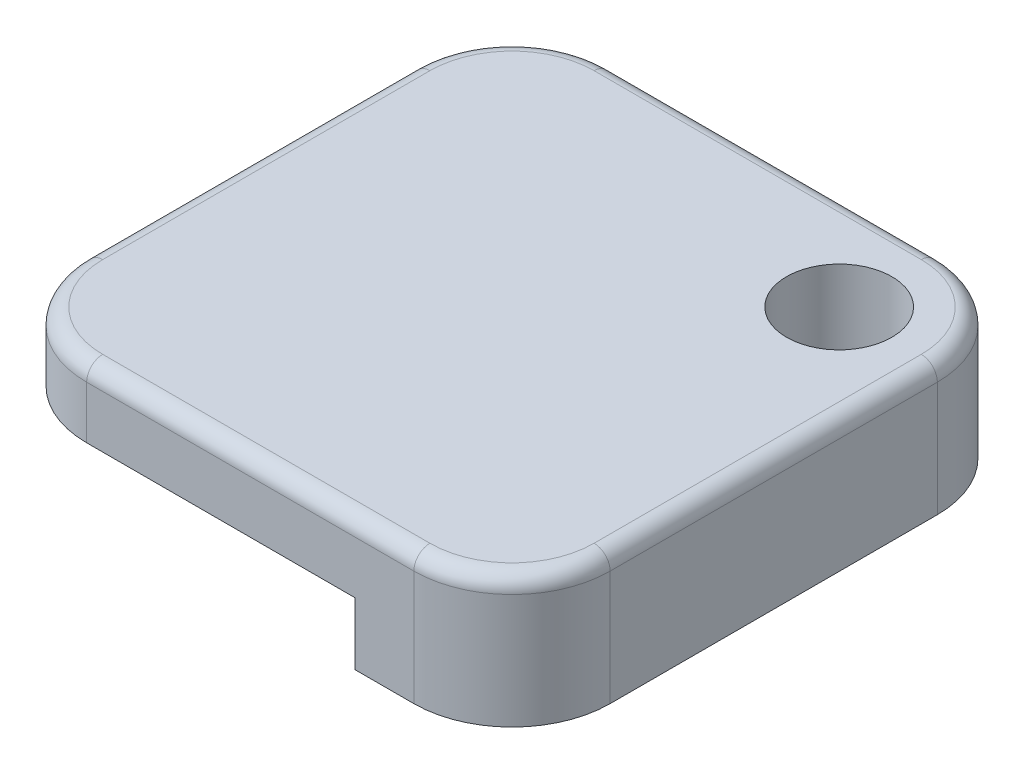
ISO-10303-21;
HEADER;
FILE_DESCRIPTION(('STEP AP214'),'2;1');
FILE_NAME('part.step','',(''),(''),'','','');
FILE_SCHEMA(('AUTOMOTIVE_DESIGN { 1 0 10303 214 1 1 1 1 }'));
ENDSEC;
DATA;
#1=APPLICATION_CONTEXT('core data for automotive mechanical design processes');
#2=APPLICATION_PROTOCOL_DEFINITION('international standard','automotive_design',2000,#1);
#3=PRODUCT_CONTEXT('',#1,'mechanical');
#4=PRODUCT('Part','Part','',(#3));
#5=PRODUCT_RELATED_PRODUCT_CATEGORY('part','',(#4));
#6=PRODUCT_DEFINITION_FORMATION('','',#4);
#7=PRODUCT_DEFINITION_CONTEXT('part definition',#1,'design');
#8=PRODUCT_DEFINITION('design','',#6,#7);
#9=PRODUCT_DEFINITION_SHAPE('','',#8);
#10=(LENGTH_UNIT() NAMED_UNIT(*) SI_UNIT(.MILLI.,.METRE.));
#11=(NAMED_UNIT(*) PLANE_ANGLE_UNIT() SI_UNIT($,.RADIAN.));
#12=(NAMED_UNIT(*) SI_UNIT($,.STERADIAN.) SOLID_ANGLE_UNIT());
#13=UNCERTAINTY_MEASURE_WITH_UNIT(LENGTH_MEASURE(1.E-05),#10,'distance_accuracy_value','');
#14=(GEOMETRIC_REPRESENTATION_CONTEXT(3) GLOBAL_UNCERTAINTY_ASSIGNED_CONTEXT((#13)) GLOBAL_UNIT_ASSIGNED_CONTEXT((#10,
#11,#12)) REPRESENTATION_CONTEXT('',''));
#15=CARTESIAN_POINT('',(0.,0.,0.));
#16=DIRECTION('',(0.,0.,1.));
#17=DIRECTION('',(1.,0.,0.));
#18=AXIS2_PLACEMENT_3D('',#15,#16,#17);
#19=CARTESIAN_POINT('',(12.7,6.35,-12.7));
#20=DIRECTION('',(-1.,0.,0.));
#21=DIRECTION('',(0.,0.,1.));
#22=AXIS2_PLACEMENT_3D('',#19,#20,#21);
#23=PLANE('',#22);
#24=DIRECTION('',(0.,-1.,0.));
#25=VECTOR('',#24,1.);
#26=CARTESIAN_POINT('',(12.7,6.35,-7.9375));
#27=LINE('',#26,#25);
#28=CARTESIAN_POINT('',(12.7,0.,-7.9375));
#29=VERTEX_POINT('',#28);
#30=CARTESIAN_POINT('',(12.7,5.57,-7.9375));
#31=VERTEX_POINT('',#30);
#32=EDGE_CURVE('E206',#29,#31,#27,.F.);
#33=ORIENTED_EDGE('',*,*,#32,.T.);
#34=DIRECTION('',(0.,0.,-1.));
#35=VECTOR('',#34,1.);
#36=CARTESIAN_POINT('',(12.7,5.57,7.93749999999999));
#37=LINE('',#36,#35);
#38=CARTESIAN_POINT('',(12.7,5.57,7.93749999999999));
#39=VERTEX_POINT('',#38);
#40=EDGE_CURVE('E229',#31,#39,#37,.F.);
#41=ORIENTED_EDGE('',*,*,#40,.T.);
#42=DIRECTION('',(0.,-1.,0.));
#43=VECTOR('',#42,1.);
#44=CARTESIAN_POINT('',(12.7,6.35,7.93749999999999));
#45=LINE('',#44,#43);
#46=CARTESIAN_POINT('',(12.7,0.,7.93749999999999));
#47=VERTEX_POINT('',#46);
#48=EDGE_CURVE('E204',#39,#47,#45,.T.);
#49=ORIENTED_EDGE('',*,*,#48,.T.);
#50=DIRECTION('',(0.,0.,-1.));
#51=VECTOR('',#50,1.);
#52=CARTESIAN_POINT('',(12.7,0.,-12.7));
#53=LINE('',#52,#51);
#54=EDGE_CURVE('E174',#47,#29,#53,.T.);
#55=ORIENTED_EDGE('',*,*,#54,.T.);
#56=EDGE_LOOP('',(#33,#41,#49,#55));
#57=FACE_BOUND('',#56,.T.);
#58=ADVANCED_FACE('F33',(#57),#23,.F.);
#59=CARTESIAN_POINT('',(-12.7,6.35,-12.7));
#60=DIRECTION('',(0.,0.,1.));
#61=DIRECTION('',(1.,0.,0.));
#62=AXIS2_PLACEMENT_3D('',#59,#60,#61);
#63=PLANE('',#62);
#64=DIRECTION('',(0.,-1.,0.));
#65=VECTOR('',#64,1.);
#66=CARTESIAN_POINT('',(-7.9375,6.35,-12.7));
#67=LINE('',#66,#65);
#68=CARTESIAN_POINT('',(-7.9375,0.,-12.7));
#69=VERTEX_POINT('',#68);
#70=CARTESIAN_POINT('',(-7.9375,5.57,-12.7));
#71=VERTEX_POINT('',#70);
#72=EDGE_CURVE('E202',#69,#71,#67,.F.);
#73=ORIENTED_EDGE('',*,*,#72,.T.);
#74=DIRECTION('',(-1.,0.,0.));
#75=VECTOR('',#74,1.);
#76=CARTESIAN_POINT('',(7.93749999999999,5.57,-12.7));
#77=LINE('',#76,#75);
#78=CARTESIAN_POINT('',(7.93749999999999,5.57,-12.7));
#79=VERTEX_POINT('',#78);
#80=EDGE_CURVE('E11',#71,#79,#77,.F.);
#81=ORIENTED_EDGE('',*,*,#80,.T.);
#82=DIRECTION('',(0.,-1.,0.));
#83=VECTOR('',#82,1.);
#84=CARTESIAN_POINT('',(7.93749999999999,6.35,-12.7));
#85=LINE('',#84,#83);
#86=CARTESIAN_POINT('',(7.93749999999999,0.,-12.7));
#87=VERTEX_POINT('',#86);
#88=EDGE_CURVE('E200',#79,#87,#85,.T.);
#89=ORIENTED_EDGE('',*,*,#88,.T.);
#90=DIRECTION('',(-1.,0.,0.));
#91=VECTOR('',#90,1.);
#92=CARTESIAN_POINT('',(-12.7,0.,-12.7));
#93=LINE('',#92,#91);
#94=EDGE_CURVE('E177',#87,#69,#93,.T.);
#95=ORIENTED_EDGE('',*,*,#94,.T.);
#96=EDGE_LOOP('',(#73,#81,#89,#95));
#97=FACE_BOUND('',#96,.T.);
#98=ADVANCED_FACE('F313',(#97),#63,.F.);
#99=CARTESIAN_POINT('',(-12.7,6.35,-12.7));
#100=DIRECTION('',(1.,0.,0.));
#101=DIRECTION('',(0.,0.,-1.));
#102=AXIS2_PLACEMENT_3D('',#99,#100,#101);
#103=PLANE('',#102);
#104=DIRECTION('',(0.,-1.,0.));
#105=VECTOR('',#104,1.);
#106=CARTESIAN_POINT('',(-12.7,6.35,7.93749999999999));
#107=LINE('',#106,#105);
#108=CARTESIAN_POINT('',(-12.7,3.0226,7.9375));
#109=VERTEX_POINT('',#108);
#110=CARTESIAN_POINT('',(-12.7,5.57,7.93749999999999));
#111=VERTEX_POINT('',#110);
#112=EDGE_CURVE('E192',#109,#111,#107,.F.);
#113=ORIENTED_EDGE('',*,*,#112,.T.);
#114=DIRECTION('',(0.,0.,1.));
#115=VECTOR('',#114,1.);
#116=CARTESIAN_POINT('',(-12.7,5.57,-7.9375));
#117=LINE('',#116,#115);
#118=CARTESIAN_POINT('',(-12.7,5.57,-7.9375));
#119=VERTEX_POINT('',#118);
#120=EDGE_CURVE('E57',#111,#119,#117,.F.);
#121=ORIENTED_EDGE('',*,*,#120,.T.);
#122=DIRECTION('',(0.,-1.,0.));
#123=VECTOR('',#122,1.);
#124=CARTESIAN_POINT('',(-12.7,6.35,-7.9375));
#125=LINE('',#124,#123);
#126=CARTESIAN_POINT('',(-12.7,0.,-7.9375));
#127=VERTEX_POINT('',#126);
#128=EDGE_CURVE('E190',#119,#127,#125,.T.);
#129=ORIENTED_EDGE('',*,*,#128,.T.);
#130=DIRECTION('',(0.,0.,1.));
#131=VECTOR('',#130,1.);
#132=CARTESIAN_POINT('',(-12.7,0.,-12.7));
#133=LINE('',#132,#131);
#134=CARTESIAN_POINT('',(-12.7,0.,-5.08000000000001));
#135=VERTEX_POINT('',#134);
#136=EDGE_CURVE('E166',#127,#135,#133,.T.);
#137=ORIENTED_EDGE('',*,*,#136,.T.);
#138=DIRECTION('',(0.,-1.,0.));
#139=VECTOR('',#138,1.);
#140=CARTESIAN_POINT('',(-12.7,3.0226,-5.08000000000001));
#141=LINE('',#140,#139);
#142=CARTESIAN_POINT('',(-12.7,3.0226,-5.08000000000001));
#143=VERTEX_POINT('',#142);
#144=EDGE_CURVE('E158',#143,#135,#141,.T.);
#145=ORIENTED_EDGE('',*,*,#144,.F.);
#146=DIRECTION('',(0.,0.,-1.));
#147=VECTOR('',#146,1.);
#148=CARTESIAN_POINT('',(-12.7,3.0226,12.7));
#149=LINE('',#148,#147);
#150=EDGE_CURVE('E142',#109,#143,#149,.T.);
#151=ORIENTED_EDGE('',*,*,#150,.F.);
#152=EDGE_LOOP('',(#113,#121,#129,#137,#145,#151));
#153=FACE_BOUND('',#152,.T.);
#154=ADVANCED_FACE('F164',(#153),#103,.F.);
#155=CARTESIAN_POINT('',(-12.7,6.35,12.7));
#156=DIRECTION('',(0.,0.,-1.));
#157=DIRECTION('',(-1.,0.,0.));
#158=AXIS2_PLACEMENT_3D('',#155,#156,#157);
#159=PLANE('',#158);
#160=DIRECTION('',(0.,-1.,0.));
#161=VECTOR('',#160,1.);
#162=CARTESIAN_POINT('',(7.9375,6.35,12.7));
#163=LINE('',#162,#161);
#164=CARTESIAN_POINT('',(7.9375,0.,12.7));
#165=VERTEX_POINT('',#164);
#166=CARTESIAN_POINT('',(7.9375,5.57,12.7));
#167=VERTEX_POINT('',#166);
#168=EDGE_CURVE('E184',#165,#167,#163,.F.);
#169=ORIENTED_EDGE('',*,*,#168,.T.);
#170=DIRECTION('',(1.,0.,0.));
#171=VECTOR('',#170,1.);
#172=CARTESIAN_POINT('',(-7.9375,5.57,12.7));
#173=LINE('',#172,#171);
#174=CARTESIAN_POINT('',(-7.9375,5.57,12.7));
#175=VERTEX_POINT('',#174);
#176=EDGE_CURVE('E233',#167,#175,#173,.F.);
#177=ORIENTED_EDGE('',*,*,#176,.T.);
#178=DIRECTION('',(0.,-1.,0.));
#179=VECTOR('',#178,1.);
#180=CARTESIAN_POINT('',(-7.9375,6.35,12.7));
#181=LINE('',#180,#179);
#182=CARTESIAN_POINT('',(-7.9375,3.0226,12.7));
#183=VERTEX_POINT('',#182);
#184=EDGE_CURVE('E187',#175,#183,#181,.T.);
#185=ORIENTED_EDGE('',*,*,#184,.T.);
#186=DIRECTION('',(-1.,0.,0.));
#187=VECTOR('',#186,1.);
#188=CARTESIAN_POINT('',(-12.7,3.0226,12.7));
#189=LINE('',#188,#187);
#190=CARTESIAN_POINT('',(5.08,3.0226,12.7));
#191=VERTEX_POINT('',#190);
#192=EDGE_CURVE('E167',#191,#183,#189,.T.);
#193=ORIENTED_EDGE('',*,*,#192,.F.);
#194=DIRECTION('',(0.,-1.,0.));
#195=VECTOR('',#194,1.);
#196=CARTESIAN_POINT('',(5.08,3.0226,12.7));
#197=LINE('',#196,#195);
#198=CARTESIAN_POINT('',(5.08,0.,12.7));
#199=VERTEX_POINT('',#198);
#200=EDGE_CURVE('E169',#191,#199,#197,.T.);
#201=ORIENTED_EDGE('',*,*,#200,.T.);
#202=DIRECTION('',(1.,0.,0.));
#203=VECTOR('',#202,1.);
#204=CARTESIAN_POINT('',(-12.7,0.,12.7));
#205=LINE('',#204,#203);
#206=EDGE_CURVE('E181',#199,#165,#205,.T.);
#207=ORIENTED_EDGE('',*,*,#206,.T.);
#208=EDGE_LOOP('',(#169,#177,#185,#193,#201,#207));
#209=FACE_BOUND('',#208,.T.);
#210=ADVANCED_FACE('F280',(#209),#159,.F.);
#211=CARTESIAN_POINT('',(0.,6.35,0.));
#212=DIRECTION('',(0.,1.,0.));
#213=DIRECTION('',(0.,0.,1.));
#214=AXIS2_PLACEMENT_3D('',#211,#212,#213);
#215=PLANE('',#214);
#216=DIRECTION('',(0.,0.,-1.));
#217=VECTOR('',#216,1.);
#218=CARTESIAN_POINT('',(11.92,6.35,-7.9375));
#219=LINE('',#218,#217);
#220=CARTESIAN_POINT('',(11.92,6.35,7.93749999999999));
#221=VERTEX_POINT('',#220);
#222=CARTESIAN_POINT('',(11.92,6.35,-7.9375));
#223=VERTEX_POINT('',#222);
#224=EDGE_CURVE('E221',#221,#223,#219,.T.);
#225=ORIENTED_EDGE('',*,*,#224,.T.);
#226=CARTESIAN_POINT('',(7.93749999999999,6.35,-7.9375));
#227=DIRECTION('',(0.,1.,0.));
#228=DIRECTION('',(0.,0.,1.));
#229=AXIS2_PLACEMENT_3D('',#226,#227,#228);
#230=CIRCLE('',#229,3.9825);
#231=CARTESIAN_POINT('',(7.93749999999999,6.35,-11.92));
#232=VERTEX_POINT('',#231);
#233=EDGE_CURVE('E223',#223,#232,#230,.T.);
#234=ORIENTED_EDGE('',*,*,#233,.T.);
#235=DIRECTION('',(-1.,0.,0.));
#236=VECTOR('',#235,1.);
#237=CARTESIAN_POINT('',(-7.9375,6.35,-11.92));
#238=LINE('',#237,#236);
#239=CARTESIAN_POINT('',(-7.9375,6.35,-11.92));
#240=VERTEX_POINT('',#239);
#241=EDGE_CURVE('E209',#232,#240,#238,.T.);
#242=ORIENTED_EDGE('',*,*,#241,.T.);
#243=CARTESIAN_POINT('',(-7.9375,6.35,-7.9375));
#244=DIRECTION('',(0.,1.,0.));
#245=DIRECTION('',(0.,0.,1.));
#246=AXIS2_PLACEMENT_3D('',#243,#244,#245);
#247=CIRCLE('',#246,3.9825);
#248=CARTESIAN_POINT('',(-11.92,6.35,-7.9375));
#249=VERTEX_POINT('',#248);
#250=EDGE_CURVE('E211',#240,#249,#247,.T.);
#251=ORIENTED_EDGE('',*,*,#250,.T.);
#252=DIRECTION('',(0.,0.,1.));
#253=VECTOR('',#252,1.);
#254=CARTESIAN_POINT('',(-11.92,6.35,7.93749999999999));
#255=LINE('',#254,#253);
#256=CARTESIAN_POINT('',(-11.92,6.35,7.93749999999999));
#257=VERTEX_POINT('',#256);
#258=EDGE_CURVE('E213',#249,#257,#255,.T.);
#259=ORIENTED_EDGE('',*,*,#258,.T.);
#260=CARTESIAN_POINT('',(-7.9375,6.35,7.9375));
#261=DIRECTION('',(0.,1.,0.));
#262=DIRECTION('',(0.,0.,1.));
#263=AXIS2_PLACEMENT_3D('',#260,#261,#262);
#264=CIRCLE('',#263,3.9825);
#265=CARTESIAN_POINT('',(-7.9375,6.35,11.92));
#266=VERTEX_POINT('',#265);
#267=EDGE_CURVE('E215',#257,#266,#264,.T.);
#268=ORIENTED_EDGE('',*,*,#267,.T.);
#269=DIRECTION('',(1.,0.,0.));
#270=VECTOR('',#269,1.);
#271=CARTESIAN_POINT('',(7.9375,6.35,11.92));
#272=LINE('',#271,#270);
#273=CARTESIAN_POINT('',(7.9375,6.35,11.92));
#274=VERTEX_POINT('',#273);
#275=EDGE_CURVE('E217',#266,#274,#272,.T.);
#276=ORIENTED_EDGE('',*,*,#275,.T.);
#277=CARTESIAN_POINT('',(7.9375,6.35,7.93749999999999));
#278=DIRECTION('',(0.,1.,0.));
#279=DIRECTION('',(0.,0.,1.));
#280=AXIS2_PLACEMENT_3D('',#277,#278,#279);
#281=CIRCLE('',#280,3.9825);
#282=EDGE_CURVE('E219',#274,#221,#281,.T.);
#283=ORIENTED_EDGE('',*,*,#282,.T.);
#284=EDGE_LOOP('',(#225,#234,#242,#251,#259,#268,#276,#283));
#285=FACE_BOUND('',#284,.T.);
#286=CARTESIAN_POINT('',(7.93749999999999,6.35,-7.9375));
#287=DIRECTION('',(0.,1.,0.));
#288=DIRECTION('',(0.,0.,1.));
#289=AXIS2_PLACEMENT_3D('',#286,#287,#288);
#290=CIRCLE('',#289,2.5527);
#291=CARTESIAN_POINT('',(7.93749999999999,6.35,-5.3848));
#292=VERTEX_POINT('',#291);
#293=EDGE_CURVE('E260',#292,#292,#290,.T.);
#294=ORIENTED_EDGE('',*,*,#293,.F.);
#295=EDGE_LOOP('',(#294));
#296=FACE_BOUND('',#295,.T.);
#297=ADVANCED_FACE('F301',(#285,#296),#215,.T.);
#298=CARTESIAN_POINT('',(0.,0.,0.));
#299=DIRECTION('',(0.,1.,0.));
#300=DIRECTION('',(0.,0.,1.));
#301=AXIS2_PLACEMENT_3D('',#298,#299,#300);
#302=PLANE('',#301);
#303=CARTESIAN_POINT('',(7.93749999999999,0.,-7.9375));
#304=DIRECTION('',(0.,1.,0.));
#305=DIRECTION('',(0.,0.,1.));
#306=AXIS2_PLACEMENT_3D('',#303,#304,#305);
#307=CIRCLE('',#306,2.5527);
#308=CARTESIAN_POINT('',(7.93749999999999,0.,-5.3848));
#309=VERTEX_POINT('',#308);
#310=EDGE_CURVE('E266',#309,#309,#307,.T.);
#311=ORIENTED_EDGE('',*,*,#310,.T.);
#312=EDGE_LOOP('',(#311));
#313=FACE_BOUND('',#312,.T.);
#314=ORIENTED_EDGE('',*,*,#136,.F.);
#315=CARTESIAN_POINT('',(-7.9375,0.,-7.9375));
#316=DIRECTION('',(0.,1.,0.));
#317=DIRECTION('',(0.,0.,1.));
#318=AXIS2_PLACEMENT_3D('',#315,#316,#317);
#319=CIRCLE('',#318,4.7625);
#320=EDGE_CURVE('E198',#127,#69,#319,.F.);
#321=ORIENTED_EDGE('',*,*,#320,.T.);
#322=ORIENTED_EDGE('',*,*,#94,.F.);
#323=CARTESIAN_POINT('',(7.93749999999999,0.,-7.9375));
#324=DIRECTION('',(0.,1.,0.));
#325=DIRECTION('',(0.,0.,1.));
#326=AXIS2_PLACEMENT_3D('',#323,#324,#325);
#327=CIRCLE('',#326,4.7625);
#328=EDGE_CURVE('E196',#87,#29,#327,.F.);
#329=ORIENTED_EDGE('',*,*,#328,.T.);
#330=ORIENTED_EDGE('',*,*,#54,.F.);
#331=CARTESIAN_POINT('',(7.9375,0.,7.93749999999999));
#332=DIRECTION('',(0.,1.,0.));
#333=DIRECTION('',(0.,0.,1.));
#334=AXIS2_PLACEMENT_3D('',#331,#332,#333);
#335=CIRCLE('',#334,4.7625);
#336=EDGE_CURVE('E194',#47,#165,#335,.F.);
#337=ORIENTED_EDGE('',*,*,#336,.T.);
#338=ORIENTED_EDGE('',*,*,#206,.F.);
#339=DIRECTION('',(0.,0.,1.));
#340=VECTOR('',#339,1.);
#341=CARTESIAN_POINT('',(5.08,0.,12.7));
#342=LINE('',#341,#340);
#343=CARTESIAN_POINT('',(5.08000000000001,0.,-5.08000000000001));
#344=VERTEX_POINT('',#343);
#345=EDGE_CURVE('E152',#344,#199,#342,.T.);
#346=ORIENTED_EDGE('',*,*,#345,.F.);
#347=DIRECTION('',(1.,0.,0.));
#348=VECTOR('',#347,1.);
#349=CARTESIAN_POINT('',(-12.7,0.,-5.08000000000001));
#350=LINE('',#349,#348);
#351=EDGE_CURVE('E271',#135,#344,#350,.T.);
#352=ORIENTED_EDGE('',*,*,#351,.F.);
#353=EDGE_LOOP('',(#314,#321,#322,#329,#330,#337,#338,#346,#352));
#354=FACE_BOUND('',#353,.T.);
#355=ADVANCED_FACE('F285',(#313,#354),#302,.F.);
#356=CARTESIAN_POINT('',(5.08,3.0226,12.7));
#357=DIRECTION('',(1.,0.,0.));
#358=DIRECTION('',(0.,0.,-1.));
#359=AXIS2_PLACEMENT_3D('',#356,#357,#358);
#360=PLANE('',#359);
#361=ORIENTED_EDGE('',*,*,#345,.T.);
#362=ORIENTED_EDGE('',*,*,#200,.F.);
#363=DIRECTION('',(0.,0.,1.));
#364=VECTOR('',#363,1.);
#365=CARTESIAN_POINT('',(5.08,3.0226,12.7));
#366=LINE('',#365,#364);
#367=CARTESIAN_POINT('',(5.08000000000001,3.0226,-5.08000000000001));
#368=VERTEX_POINT('',#367);
#369=EDGE_CURVE('E162',#368,#191,#366,.T.);
#370=ORIENTED_EDGE('',*,*,#369,.F.);
#371=DIRECTION('',(0.,-1.,0.));
#372=VECTOR('',#371,1.);
#373=CARTESIAN_POINT('',(5.08000000000001,3.0226,-5.08000000000001));
#374=LINE('',#373,#372);
#375=EDGE_CURVE('E160',#368,#344,#374,.T.);
#376=ORIENTED_EDGE('',*,*,#375,.T.);
#377=EDGE_LOOP('',(#361,#362,#370,#376));
#378=FACE_BOUND('',#377,.T.);
#379=ADVANCED_FACE('F309',(#378),#360,.F.);
#380=CARTESIAN_POINT('',(-12.7,3.0226,-5.08000000000001));
#381=DIRECTION('',(0.,0.,-1.));
#382=DIRECTION('',(-1.,0.,0.));
#383=AXIS2_PLACEMENT_3D('',#380,#381,#382);
#384=PLANE('',#383);
#385=ORIENTED_EDGE('',*,*,#351,.T.);
#386=ORIENTED_EDGE('',*,*,#375,.F.);
#387=DIRECTION('',(1.,0.,0.));
#388=VECTOR('',#387,1.);
#389=CARTESIAN_POINT('',(-12.7,3.0226,-5.08000000000001));
#390=LINE('',#389,#388);
#391=EDGE_CURVE('E147',#143,#368,#390,.T.);
#392=ORIENTED_EDGE('',*,*,#391,.F.);
#393=ORIENTED_EDGE('',*,*,#144,.T.);
#394=EDGE_LOOP('',(#385,#386,#392,#393));
#395=FACE_BOUND('',#394,.T.);
#396=ADVANCED_FACE('F157',(#395),#384,.F.);
#397=CARTESIAN_POINT('',(0.,3.0226,0.));
#398=DIRECTION('',(0.,-1.,0.));
#399=DIRECTION('',(0.,0.,-1.));
#400=AXIS2_PLACEMENT_3D('',#397,#398,#399);
#401=PLANE('',#400);
#402=ORIENTED_EDGE('',*,*,#192,.T.);
#403=CARTESIAN_POINT('',(-7.9375,3.0226,7.9375));
#404=DIRECTION('',(0.,-1.,0.));
#405=DIRECTION('',(0.,0.,-1.));
#406=AXIS2_PLACEMENT_3D('',#403,#404,#405);
#407=CIRCLE('',#406,4.7625);
#408=EDGE_CURVE('E149',#183,#109,#407,.T.);
#409=ORIENTED_EDGE('',*,*,#408,.T.);
#410=ORIENTED_EDGE('',*,*,#150,.T.);
#411=ORIENTED_EDGE('',*,*,#391,.T.);
#412=ORIENTED_EDGE('',*,*,#369,.T.);
#413=EDGE_LOOP('',(#402,#409,#410,#411,#412));
#414=FACE_BOUND('',#413,.T.);
#415=ADVANCED_FACE('F145',(#414),#401,.T.);
#416=CARTESIAN_POINT('',(-7.9375,6.35,7.9375));
#417=DIRECTION('',(0.,-1.,0.));
#418=DIRECTION('',(0.,0.,-1.));
#419=AXIS2_PLACEMENT_3D('',#416,#417,#418);
#420=CYLINDRICAL_SURFACE('',#419,4.7625);
#421=ORIENTED_EDGE('',*,*,#184,.F.);
#422=CARTESIAN_POINT('',(-7.9375,5.57,7.9375));
#423=DIRECTION('',(0.,1.,0.));
#424=DIRECTION('',(0.,0.,1.));
#425=AXIS2_PLACEMENT_3D('',#422,#423,#424);
#426=CIRCLE('',#425,4.7625);
#427=EDGE_CURVE('E235',#175,#111,#426,.F.);
#428=ORIENTED_EDGE('',*,*,#427,.T.);
#429=ORIENTED_EDGE('',*,*,#112,.F.);
#430=ORIENTED_EDGE('',*,*,#408,.F.);
#431=EDGE_LOOP('',(#421,#428,#429,#430));
#432=FACE_BOUND('',#431,.T.);
#433=ADVANCED_FACE('F308',(#432),#420,.T.);
#434=CARTESIAN_POINT('',(-7.9375,6.35,-7.9375));
#435=DIRECTION('',(0.,-1.,0.));
#436=DIRECTION('',(0.,0.,-1.));
#437=AXIS2_PLACEMENT_3D('',#434,#435,#436);
#438=CYLINDRICAL_SURFACE('',#437,4.7625);
#439=ORIENTED_EDGE('',*,*,#128,.F.);
#440=CARTESIAN_POINT('',(-7.9375,5.57,-7.9375));
#441=DIRECTION('',(0.,1.,0.));
#442=DIRECTION('',(0.,0.,1.));
#443=AXIS2_PLACEMENT_3D('',#440,#441,#442);
#444=CIRCLE('',#443,4.7625);
#445=EDGE_CURVE('E42',#119,#71,#444,.F.);
#446=ORIENTED_EDGE('',*,*,#445,.T.);
#447=ORIENTED_EDGE('',*,*,#72,.F.);
#448=ORIENTED_EDGE('',*,*,#320,.F.);
#449=EDGE_LOOP('',(#439,#446,#447,#448));
#450=FACE_BOUND('',#449,.T.);
#451=ADVANCED_FACE('F317',(#450),#438,.T.);
#452=CARTESIAN_POINT('',(7.93749999999999,6.35,-7.9375));
#453=DIRECTION('',(0.,-1.,0.));
#454=DIRECTION('',(0.,0.,-1.));
#455=AXIS2_PLACEMENT_3D('',#452,#453,#454);
#456=CYLINDRICAL_SURFACE('',#455,4.7625);
#457=ORIENTED_EDGE('',*,*,#88,.F.);
#458=CARTESIAN_POINT('',(7.93749999999999,5.57,-7.9375));
#459=DIRECTION('',(0.,1.,0.));
#460=DIRECTION('',(0.,0.,1.));
#461=AXIS2_PLACEMENT_3D('',#458,#459,#460);
#462=CIRCLE('',#461,4.7625);
#463=EDGE_CURVE('E226',#79,#31,#462,.F.);
#464=ORIENTED_EDGE('',*,*,#463,.T.);
#465=ORIENTED_EDGE('',*,*,#32,.F.);
#466=ORIENTED_EDGE('',*,*,#328,.F.);
#467=EDGE_LOOP('',(#457,#464,#465,#466));
#468=FACE_BOUND('',#467,.T.);
#469=ADVANCED_FACE('F320',(#468),#456,.T.);
#470=CARTESIAN_POINT('',(7.9375,6.35,7.93749999999999));
#471=DIRECTION('',(0.,-1.,0.));
#472=DIRECTION('',(0.,0.,-1.));
#473=AXIS2_PLACEMENT_3D('',#470,#471,#472);
#474=CYLINDRICAL_SURFACE('',#473,4.7625);
#475=ORIENTED_EDGE('',*,*,#48,.F.);
#476=CARTESIAN_POINT('',(7.9375,5.57,7.93749999999999));
#477=DIRECTION('',(0.,1.,0.));
#478=DIRECTION('',(0.,0.,1.));
#479=AXIS2_PLACEMENT_3D('',#476,#477,#478);
#480=CIRCLE('',#479,4.7625);
#481=EDGE_CURVE('E231',#39,#167,#480,.F.);
#482=ORIENTED_EDGE('',*,*,#481,.T.);
#483=ORIENTED_EDGE('',*,*,#168,.F.);
#484=ORIENTED_EDGE('',*,*,#336,.F.);
#485=EDGE_LOOP('',(#475,#482,#483,#484));
#486=FACE_BOUND('',#485,.T.);
#487=ADVANCED_FACE('F290',(#486),#474,.T.);
#488=CARTESIAN_POINT('',(7.93749999999999,6.35,-7.9375));
#489=DIRECTION('',(0.,1.,0.));
#490=DIRECTION('',(0.,0.,1.));
#491=AXIS2_PLACEMENT_3D('',#488,#489,#490);
#492=CYLINDRICAL_SURFACE('',#491,2.5527);
#493=ORIENTED_EDGE('',*,*,#293,.T.);
#494=EDGE_LOOP('',(#493));
#495=FACE_BOUND('',#494,.T.);
#496=ORIENTED_EDGE('',*,*,#310,.F.);
#497=EDGE_LOOP('',(#496));
#498=FACE_BOUND('',#497,.T.);
#499=ADVANCED_FACE('F353',(#495,#498),#492,.F.);
#500=CARTESIAN_POINT('',(-7.9375,5.57,7.9375));
#501=DIRECTION('',(0.,1.,0.));
#502=DIRECTION('',(0.,0.,1.));
#503=AXIS2_PLACEMENT_3D('',#500,#501,#502);
#504=TOROIDAL_SURFACE('',#503,3.9825,0.78);
#505=CARTESIAN_POINT('',(-11.92,5.57,7.93749999999999));
#506=DIRECTION('',(0.,0.,-1.));
#507=DIRECTION('',(-1.,0.,0.));
#508=AXIS2_PLACEMENT_3D('',#505,#506,#507);
#509=CIRCLE('',#508,0.78);
#510=EDGE_CURVE('E254',#111,#257,#509,.T.);
#511=ORIENTED_EDGE('',*,*,#510,.F.);
#512=ORIENTED_EDGE('',*,*,#427,.F.);
#513=CARTESIAN_POINT('',(-7.9375,5.57,11.92));
#514=DIRECTION('',(1.,0.,0.));
#515=DIRECTION('',(0.,0.,-1.));
#516=AXIS2_PLACEMENT_3D('',#513,#514,#515);
#517=CIRCLE('',#516,0.78);
#518=EDGE_CURVE('E37',#266,#175,#517,.T.);
#519=ORIENTED_EDGE('',*,*,#518,.F.);
#520=ORIENTED_EDGE('',*,*,#267,.F.);
#521=EDGE_LOOP('',(#511,#512,#519,#520));
#522=FACE_BOUND('',#521,.T.);
#523=ADVANCED_FACE('F35',(#522),#504,.T.);
#524=CARTESIAN_POINT('',(0.,5.57,11.92));
#525=DIRECTION('',(-1.,0.,0.));
#526=DIRECTION('',(0.,0.,1.));
#527=AXIS2_PLACEMENT_3D('',#524,#525,#526);
#528=CYLINDRICAL_SURFACE('',#527,0.78);
#529=ORIENTED_EDGE('',*,*,#518,.T.);
#530=ORIENTED_EDGE('',*,*,#176,.F.);
#531=CARTESIAN_POINT('',(7.9375,5.57,11.92));
#532=DIRECTION('',(1.,0.,0.));
#533=DIRECTION('',(0.,0.,-1.));
#534=AXIS2_PLACEMENT_3D('',#531,#532,#533);
#535=CIRCLE('',#534,0.78);
#536=EDGE_CURVE('E252',#274,#167,#535,.T.);
#537=ORIENTED_EDGE('',*,*,#536,.F.);
#538=ORIENTED_EDGE('',*,*,#275,.F.);
#539=EDGE_LOOP('',(#529,#530,#537,#538));
#540=FACE_BOUND('',#539,.T.);
#541=ADVANCED_FACE('F294',(#540),#528,.T.);
#542=CARTESIAN_POINT('',(-11.92,5.57,0.));
#543=DIRECTION('',(0.,0.,-1.));
#544=DIRECTION('',(-1.,0.,0.));
#545=AXIS2_PLACEMENT_3D('',#542,#543,#544);
#546=CYLINDRICAL_SURFACE('',#545,0.78);
#547=ORIENTED_EDGE('',*,*,#510,.T.);
#548=ORIENTED_EDGE('',*,*,#258,.F.);
#549=CARTESIAN_POINT('',(-11.92,5.57,-7.9375));
#550=DIRECTION('',(0.,0.,-1.));
#551=DIRECTION('',(-1.,0.,0.));
#552=AXIS2_PLACEMENT_3D('',#549,#550,#551);
#553=CIRCLE('',#552,0.78);
#554=EDGE_CURVE('E249',#119,#249,#553,.T.);
#555=ORIENTED_EDGE('',*,*,#554,.F.);
#556=ORIENTED_EDGE('',*,*,#120,.F.);
#557=EDGE_LOOP('',(#547,#548,#555,#556));
#558=FACE_BOUND('',#557,.T.);
#559=ADVANCED_FACE('F383',(#558),#546,.T.);
#560=CARTESIAN_POINT('',(7.9375,5.57,7.93749999999999));
#561=DIRECTION('',(0.,1.,0.));
#562=DIRECTION('',(0.,0.,1.));
#563=AXIS2_PLACEMENT_3D('',#560,#561,#562);
#564=TOROIDAL_SURFACE('',#563,3.9825,0.78);
#565=ORIENTED_EDGE('',*,*,#536,.T.);
#566=ORIENTED_EDGE('',*,*,#481,.F.);
#567=CARTESIAN_POINT('',(11.92,5.57,7.93749999999999));
#568=DIRECTION('',(0.,0.,-1.));
#569=DIRECTION('',(-1.,0.,0.));
#570=AXIS2_PLACEMENT_3D('',#567,#568,#569);
#571=CIRCLE('',#570,0.78);
#572=EDGE_CURVE('E246',#221,#39,#571,.T.);
#573=ORIENTED_EDGE('',*,*,#572,.F.);
#574=ORIENTED_EDGE('',*,*,#282,.F.);
#575=EDGE_LOOP('',(#565,#566,#573,#574));
#576=FACE_BOUND('',#575,.T.);
#577=ADVANCED_FACE('F297',(#576),#564,.T.);
#578=CARTESIAN_POINT('',(-7.9375,5.57,-7.9375));
#579=DIRECTION('',(0.,1.,0.));
#580=DIRECTION('',(0.,0.,1.));
#581=AXIS2_PLACEMENT_3D('',#578,#579,#580);
#582=TOROIDAL_SURFACE('',#581,3.9825,0.78);
#583=ORIENTED_EDGE('',*,*,#554,.T.);
#584=ORIENTED_EDGE('',*,*,#250,.F.);
#585=CARTESIAN_POINT('',(-7.9375,5.57,-11.92));
#586=DIRECTION('',(1.,0.,0.));
#587=DIRECTION('',(0.,0.,-1.));
#588=AXIS2_PLACEMENT_3D('',#585,#586,#587);
#589=CIRCLE('',#588,0.78);
#590=EDGE_CURVE('E243',#71,#240,#589,.T.);
#591=ORIENTED_EDGE('',*,*,#590,.F.);
#592=ORIENTED_EDGE('',*,*,#445,.F.);
#593=EDGE_LOOP('',(#583,#584,#591,#592));
#594=FACE_BOUND('',#593,.T.);
#595=ADVANCED_FACE('F376',(#594),#582,.T.);
#596=CARTESIAN_POINT('',(11.92,5.57,0.));
#597=DIRECTION('',(0.,0.,1.));
#598=DIRECTION('',(1.,0.,0.));
#599=AXIS2_PLACEMENT_3D('',#596,#597,#598);
#600=CYLINDRICAL_SURFACE('',#599,0.78);
#601=ORIENTED_EDGE('',*,*,#572,.T.);
#602=ORIENTED_EDGE('',*,*,#40,.F.);
#603=CARTESIAN_POINT('',(11.92,5.57,-7.9375));
#604=DIRECTION('',(0.,0.,-1.));
#605=DIRECTION('',(-1.,0.,0.));
#606=AXIS2_PLACEMENT_3D('',#603,#604,#605);
#607=CIRCLE('',#606,0.78);
#608=EDGE_CURVE('E241',#223,#31,#607,.T.);
#609=ORIENTED_EDGE('',*,*,#608,.F.);
#610=ORIENTED_EDGE('',*,*,#224,.F.);
#611=EDGE_LOOP('',(#601,#602,#609,#610));
#612=FACE_BOUND('',#611,.T.);
#613=ADVANCED_FACE('F372',(#612),#600,.T.);
#614=CARTESIAN_POINT('',(0.,5.57,-11.92));
#615=DIRECTION('',(1.,0.,0.));
#616=DIRECTION('',(0.,0.,-1.));
#617=AXIS2_PLACEMENT_3D('',#614,#615,#616);
#618=CYLINDRICAL_SURFACE('',#617,0.78);
#619=ORIENTED_EDGE('',*,*,#590,.T.);
#620=ORIENTED_EDGE('',*,*,#241,.F.);
#621=CARTESIAN_POINT('',(7.93749999999999,5.57,-11.92));
#622=DIRECTION('',(1.,0.,0.));
#623=DIRECTION('',(0.,0.,-1.));
#624=AXIS2_PLACEMENT_3D('',#621,#622,#623);
#625=CIRCLE('',#624,0.78);
#626=EDGE_CURVE('E239',#79,#232,#625,.T.);
#627=ORIENTED_EDGE('',*,*,#626,.F.);
#628=ORIENTED_EDGE('',*,*,#80,.F.);
#629=EDGE_LOOP('',(#619,#620,#627,#628));
#630=FACE_BOUND('',#629,.T.);
#631=ADVANCED_FACE('F368',(#630),#618,.T.);
#632=CARTESIAN_POINT('',(7.93749999999999,5.57,-7.9375));
#633=DIRECTION('',(0.,1.,0.));
#634=DIRECTION('',(0.,0.,1.));
#635=AXIS2_PLACEMENT_3D('',#632,#633,#634);
#636=TOROIDAL_SURFACE('',#635,3.9825,0.78);
#637=ORIENTED_EDGE('',*,*,#608,.T.);
#638=ORIENTED_EDGE('',*,*,#463,.F.);
#639=ORIENTED_EDGE('',*,*,#626,.T.);
#640=ORIENTED_EDGE('',*,*,#233,.F.);
#641=EDGE_LOOP('',(#637,#638,#639,#640));
#642=FACE_BOUND('',#641,.T.);
#643=ADVANCED_FACE('F365',(#642),#636,.T.);
#644=CLOSED_SHELL('',(#58,#98,#154,#210,#297,#355,#379,#396,#415,#433,#451,#469,#487,#499,#523,
#541,#559,#577,#595,#613,#631,#643));
#645=MANIFOLD_SOLID_BREP('B2',#644);
#646=ADVANCED_BREP_SHAPE_REPRESENTATION('',(#18,#645),#14);
#647=SHAPE_DEFINITION_REPRESENTATION(#9,#646);
ENDSEC;
END-ISO-10303-21;
